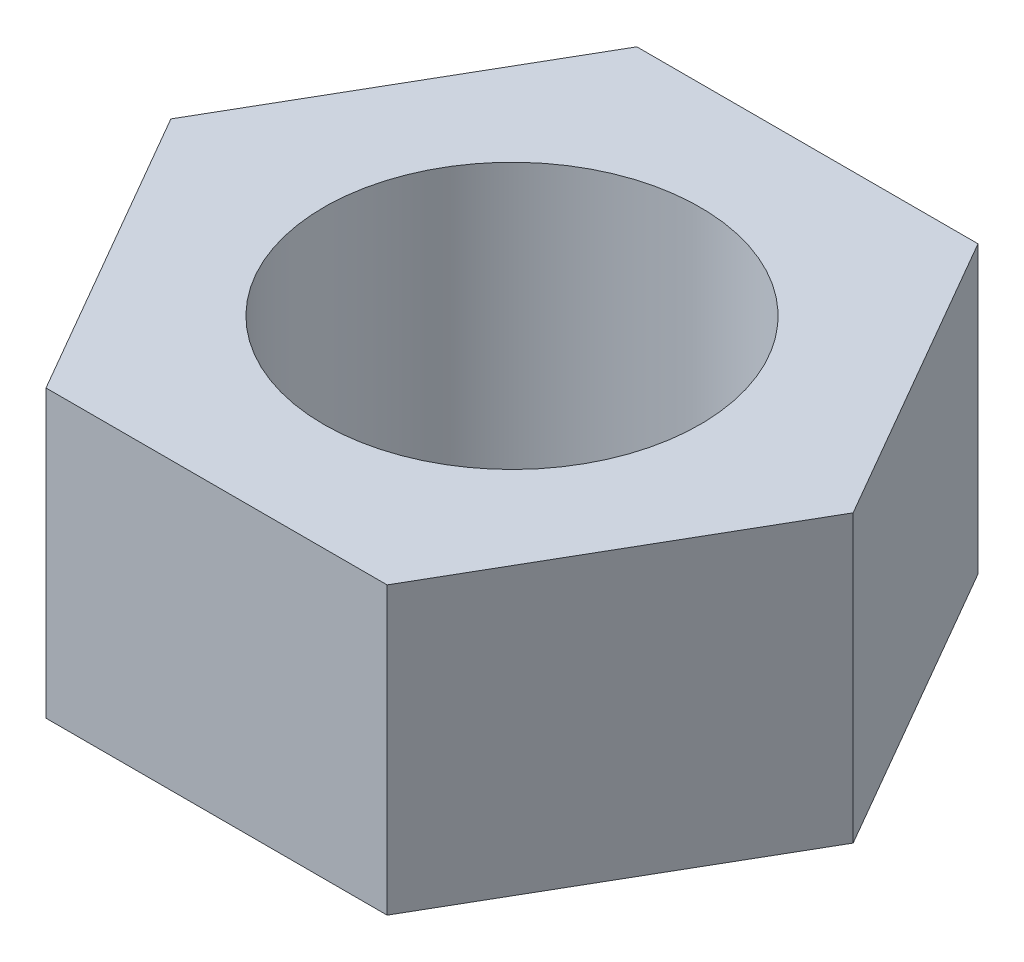
ISO-10303-21;
HEADER;
FILE_DESCRIPTION(('STEP AP214'),'2;1');
FILE_NAME('part.step','',(''),(''),'','','');
FILE_SCHEMA(('AUTOMOTIVE_DESIGN { 1 0 10303 214 1 1 1 1 }'));
ENDSEC;
DATA;
#1=APPLICATION_CONTEXT('core data for automotive mechanical design processes');
#2=APPLICATION_PROTOCOL_DEFINITION('international standard','automotive_design',2000,#1);
#3=PRODUCT_CONTEXT('',#1,'mechanical');
#4=PRODUCT('Part','Part','',(#3));
#5=PRODUCT_RELATED_PRODUCT_CATEGORY('part','',(#4));
#6=PRODUCT_DEFINITION_FORMATION('','',#4);
#7=PRODUCT_DEFINITION_CONTEXT('part definition',#1,'design');
#8=PRODUCT_DEFINITION('design','',#6,#7);
#9=PRODUCT_DEFINITION_SHAPE('','',#8);
#10=(LENGTH_UNIT() NAMED_UNIT(*) SI_UNIT(.MILLI.,.METRE.));
#11=(NAMED_UNIT(*) PLANE_ANGLE_UNIT() SI_UNIT($,.RADIAN.));
#12=(NAMED_UNIT(*) SI_UNIT($,.STERADIAN.) SOLID_ANGLE_UNIT());
#13=UNCERTAINTY_MEASURE_WITH_UNIT(LENGTH_MEASURE(1.E-05),#10,'distance_accuracy_value','');
#14=(GEOMETRIC_REPRESENTATION_CONTEXT(3) GLOBAL_UNCERTAINTY_ASSIGNED_CONTEXT((#13)) GLOBAL_UNIT_ASSIGNED_CONTEXT((#10,
#11,#12)) REPRESENTATION_CONTEXT('',''));
#15=CARTESIAN_POINT('',(0.,0.,0.));
#16=DIRECTION('',(0.,0.,1.));
#17=DIRECTION('',(1.,0.,0.));
#18=AXIS2_PLACEMENT_3D('',#15,#16,#17);
#19=CARTESIAN_POINT('',(0.,3.8,0.));
#20=DIRECTION('',(0.,1.,0.));
#21=DIRECTION('',(0.,0.,1.));
#22=AXIS2_PLACEMENT_3D('',#19,#20,#21);
#23=PLANE('',#22);
#24=DIRECTION('',(0.5,0.,-0.866025403784439));
#25=VECTOR('',#24,1.);
#26=CARTESIAN_POINT('',(2.26609980656928,3.8,3.925));
#27=LINE('',#26,#25);
#28=CARTESIAN_POINT('',(2.26609980656928,3.8,3.925));
#29=VERTEX_POINT('',#28);
#30=CARTESIAN_POINT('',(4.53219961313856,3.8,0.));
#31=VERTEX_POINT('',#30);
#32=EDGE_CURVE('E129',#29,#31,#27,.T.);
#33=ORIENTED_EDGE('',*,*,#32,.T.);
#34=DIRECTION('',(-0.5,0.,-0.866025403784439));
#35=VECTOR('',#34,1.);
#36=CARTESIAN_POINT('',(4.53219961313856,3.8,0.));
#37=LINE('',#36,#35);
#38=CARTESIAN_POINT('',(2.26609980656928,3.8,-3.925));
#39=VERTEX_POINT('',#38);
#40=EDGE_CURVE('E87',#31,#39,#37,.T.);
#41=ORIENTED_EDGE('',*,*,#40,.T.);
#42=DIRECTION('',(-1.,0.,0.));
#43=VECTOR('',#42,1.);
#44=CARTESIAN_POINT('',(2.26609980656928,3.8,-3.925));
#45=LINE('',#44,#43);
#46=CARTESIAN_POINT('',(-2.26609980656928,3.8,-3.925));
#47=VERTEX_POINT('',#46);
#48=EDGE_CURVE('E100',#39,#47,#45,.T.);
#49=ORIENTED_EDGE('',*,*,#48,.T.);
#50=DIRECTION('',(-0.5,0.,0.866025403784439));
#51=VECTOR('',#50,1.);
#52=CARTESIAN_POINT('',(-2.26609980656928,3.8,-3.925));
#53=LINE('',#52,#51);
#54=CARTESIAN_POINT('',(-4.53219961313856,3.8,0.));
#55=VERTEX_POINT('',#54);
#56=EDGE_CURVE('E94',#47,#55,#53,.T.);
#57=ORIENTED_EDGE('',*,*,#56,.T.);
#58=DIRECTION('',(0.5,0.,0.866025403784439));
#59=VECTOR('',#58,1.);
#60=CARTESIAN_POINT('',(-4.53219961313856,3.8,0.));
#61=LINE('',#60,#59);
#62=CARTESIAN_POINT('',(-2.26609980656928,3.8,3.925));
#63=VERTEX_POINT('',#62);
#64=EDGE_CURVE('E98',#55,#63,#61,.T.);
#65=ORIENTED_EDGE('',*,*,#64,.T.);
#66=DIRECTION('',(1.,0.,0.));
#67=VECTOR('',#66,1.);
#68=CARTESIAN_POINT('',(-2.26609980656928,3.8,3.925));
#69=LINE('',#68,#67);
#70=EDGE_CURVE('E50',#63,#29,#69,.T.);
#71=ORIENTED_EDGE('',*,*,#70,.T.);
#72=EDGE_LOOP('',(#33,#41,#49,#57,#65,#71));
#73=FACE_BOUND('',#72,.T.);
#74=CARTESIAN_POINT('',(0.,3.8,0.));
#75=DIRECTION('',(0.,1.,0.));
#76=DIRECTION('',(0.,0.,1.));
#77=AXIS2_PLACEMENT_3D('',#74,#75,#76);
#78=CIRCLE('',#77,2.5);
#79=CARTESIAN_POINT('',(0.,3.8,2.5));
#80=VERTEX_POINT('',#79);
#81=EDGE_CURVE('E122',#80,#80,#78,.T.);
#82=ORIENTED_EDGE('',*,*,#81,.F.);
#83=EDGE_LOOP('',(#82));
#84=FACE_BOUND('',#83,.T.);
#85=ADVANCED_FACE('F33',(#73,#84),#23,.T.);
#86=CARTESIAN_POINT('',(0.,0.,0.));
#87=DIRECTION('',(0.,1.,0.));
#88=DIRECTION('',(0.,0.,1.));
#89=AXIS2_PLACEMENT_3D('',#86,#87,#88);
#90=PLANE('',#89);
#91=DIRECTION('',(0.5,0.,-0.866025403784439));
#92=VECTOR('',#91,1.);
#93=CARTESIAN_POINT('',(2.26609980656928,0.,3.925));
#94=LINE('',#93,#92);
#95=CARTESIAN_POINT('',(2.26609980656928,0.,3.925));
#96=VERTEX_POINT('',#95);
#97=CARTESIAN_POINT('',(4.53219961313856,0.,0.));
#98=VERTEX_POINT('',#97);
#99=EDGE_CURVE('E118',#96,#98,#94,.T.);
#100=ORIENTED_EDGE('',*,*,#99,.F.);
#101=DIRECTION('',(1.,0.,0.));
#102=VECTOR('',#101,1.);
#103=CARTESIAN_POINT('',(-2.26609980656928,0.,3.925));
#104=LINE('',#103,#102);
#105=CARTESIAN_POINT('',(-2.26609980656928,0.,3.925));
#106=VERTEX_POINT('',#105);
#107=EDGE_CURVE('E79',#106,#96,#104,.T.);
#108=ORIENTED_EDGE('',*,*,#107,.F.);
#109=DIRECTION('',(0.5,0.,0.866025403784439));
#110=VECTOR('',#109,1.);
#111=CARTESIAN_POINT('',(-4.53219961313856,0.,0.));
#112=LINE('',#111,#110);
#113=CARTESIAN_POINT('',(-4.53219961313856,0.,0.));
#114=VERTEX_POINT('',#113);
#115=EDGE_CURVE('E73',#114,#106,#112,.T.);
#116=ORIENTED_EDGE('',*,*,#115,.F.);
#117=DIRECTION('',(-0.5,0.,0.866025403784439));
#118=VECTOR('',#117,1.);
#119=CARTESIAN_POINT('',(-2.26609980656928,0.,-3.925));
#120=LINE('',#119,#118);
#121=CARTESIAN_POINT('',(-2.26609980656928,0.,-3.925));
#122=VERTEX_POINT('',#121);
#123=EDGE_CURVE('E108',#122,#114,#120,.T.);
#124=ORIENTED_EDGE('',*,*,#123,.F.);
#125=DIRECTION('',(-1.,0.,0.));
#126=VECTOR('',#125,1.);
#127=CARTESIAN_POINT('',(2.26609980656928,0.,-3.925));
#128=LINE('',#127,#126);
#129=CARTESIAN_POINT('',(2.26609980656928,0.,-3.925));
#130=VERTEX_POINT('',#129);
#131=EDGE_CURVE('E124',#130,#122,#128,.T.);
#132=ORIENTED_EDGE('',*,*,#131,.F.);
#133=DIRECTION('',(-0.5,0.,-0.866025403784439));
#134=VECTOR('',#133,1.);
#135=CARTESIAN_POINT('',(4.53219961313856,0.,0.));
#136=LINE('',#135,#134);
#137=EDGE_CURVE('E121',#98,#130,#136,.T.);
#138=ORIENTED_EDGE('',*,*,#137,.F.);
#139=EDGE_LOOP('',(#100,#108,#116,#124,#132,#138));
#140=FACE_BOUND('',#139,.T.);
#141=CARTESIAN_POINT('',(0.,0.,0.));
#142=DIRECTION('',(0.,1.,0.));
#143=DIRECTION('',(0.,0.,1.));
#144=AXIS2_PLACEMENT_3D('',#141,#142,#143);
#145=CIRCLE('',#144,2.5);
#146=CARTESIAN_POINT('',(0.,0.,2.5));
#147=VERTEX_POINT('',#146);
#148=EDGE_CURVE('E222',#147,#147,#145,.T.);
#149=ORIENTED_EDGE('',*,*,#148,.T.);
#150=EDGE_LOOP('',(#149));
#151=FACE_BOUND('',#150,.T.);
#152=ADVANCED_FACE('F138',(#140,#151),#90,.F.);
#153=CARTESIAN_POINT('',(2.26609980656928,3.8,3.925));
#154=DIRECTION('',(-0.866025403784439,0.,-0.5));
#155=DIRECTION('',(-0.5,0.,0.866025403784439));
#156=AXIS2_PLACEMENT_3D('',#153,#154,#155);
#157=PLANE('',#156);
#158=ORIENTED_EDGE('',*,*,#99,.T.);
#159=DIRECTION('',(0.,-1.,0.));
#160=VECTOR('',#159,1.);
#161=CARTESIAN_POINT('',(4.53219961313856,3.8,0.));
#162=LINE('',#161,#160);
#163=EDGE_CURVE('E11',#31,#98,#162,.T.);
#164=ORIENTED_EDGE('',*,*,#163,.F.);
#165=ORIENTED_EDGE('',*,*,#32,.F.);
#166=DIRECTION('',(0.,-1.,0.));
#167=VECTOR('',#166,1.);
#168=CARTESIAN_POINT('',(2.26609980656928,3.8,3.925));
#169=LINE('',#168,#167);
#170=EDGE_CURVE('E114',#29,#96,#169,.T.);
#171=ORIENTED_EDGE('',*,*,#170,.T.);
#172=EDGE_LOOP('',(#158,#164,#165,#171));
#173=FACE_BOUND('',#172,.T.);
#174=ADVANCED_FACE('F35',(#173),#157,.F.);
#175=CARTESIAN_POINT('',(4.53219961313856,3.8,0.));
#176=DIRECTION('',(-0.866025403784438,0.,0.5));
#177=DIRECTION('',(0.5,0.,0.866025403784439));
#178=AXIS2_PLACEMENT_3D('',#175,#176,#177);
#179=PLANE('',#178);
#180=ORIENTED_EDGE('',*,*,#137,.T.);
#181=DIRECTION('',(0.,-1.,0.));
#182=VECTOR('',#181,1.);
#183=CARTESIAN_POINT('',(2.26609980656928,3.8,-3.925));
#184=LINE('',#183,#182);
#185=EDGE_CURVE('E42',#39,#130,#184,.T.);
#186=ORIENTED_EDGE('',*,*,#185,.F.);
#187=ORIENTED_EDGE('',*,*,#40,.F.);
#188=ORIENTED_EDGE('',*,*,#163,.T.);
#189=EDGE_LOOP('',(#180,#186,#187,#188));
#190=FACE_BOUND('',#189,.T.);
#191=ADVANCED_FACE('F163',(#190),#179,.F.);
#192=CARTESIAN_POINT('',(2.26609980656928,3.8,-3.925));
#193=DIRECTION('',(0.,0.,1.));
#194=DIRECTION('',(1.,0.,0.));
#195=AXIS2_PLACEMENT_3D('',#192,#193,#194);
#196=PLANE('',#195);
#197=ORIENTED_EDGE('',*,*,#131,.T.);
#198=DIRECTION('',(0.,-1.,0.));
#199=VECTOR('',#198,1.);
#200=CARTESIAN_POINT('',(-2.26609980656928,3.8,-3.925));
#201=LINE('',#200,#199);
#202=EDGE_CURVE('E109',#47,#122,#201,.T.);
#203=ORIENTED_EDGE('',*,*,#202,.F.);
#204=ORIENTED_EDGE('',*,*,#48,.F.);
#205=ORIENTED_EDGE('',*,*,#185,.T.);
#206=EDGE_LOOP('',(#197,#203,#204,#205));
#207=FACE_BOUND('',#206,.T.);
#208=ADVANCED_FACE('F135',(#207),#196,.F.);
#209=CARTESIAN_POINT('',(-2.26609980656928,3.8,-3.925));
#210=DIRECTION('',(0.866025403784439,0.,0.5));
#211=DIRECTION('',(0.5,0.,-0.866025403784439));
#212=AXIS2_PLACEMENT_3D('',#209,#210,#211);
#213=PLANE('',#212);
#214=ORIENTED_EDGE('',*,*,#123,.T.);
#215=DIRECTION('',(0.,-1.,0.));
#216=VECTOR('',#215,1.);
#217=CARTESIAN_POINT('',(-4.53219961313856,3.8,0.));
#218=LINE('',#217,#216);
#219=EDGE_CURVE('E105',#55,#114,#218,.T.);
#220=ORIENTED_EDGE('',*,*,#219,.F.);
#221=ORIENTED_EDGE('',*,*,#56,.F.);
#222=ORIENTED_EDGE('',*,*,#202,.T.);
#223=EDGE_LOOP('',(#214,#220,#221,#222));
#224=FACE_BOUND('',#223,.T.);
#225=ADVANCED_FACE('F106',(#224),#213,.F.);
#226=CARTESIAN_POINT('',(-4.53219961313856,3.8,0.));
#227=DIRECTION('',(0.866025403784439,0.,-0.5));
#228=DIRECTION('',(-0.5,0.,-0.866025403784439));
#229=AXIS2_PLACEMENT_3D('',#226,#227,#228);
#230=PLANE('',#229);
#231=ORIENTED_EDGE('',*,*,#115,.T.);
#232=DIRECTION('',(0.,-1.,0.));
#233=VECTOR('',#232,1.);
#234=CARTESIAN_POINT('',(-2.26609980656928,3.8,3.925));
#235=LINE('',#234,#233);
#236=EDGE_CURVE('E110',#63,#106,#235,.T.);
#237=ORIENTED_EDGE('',*,*,#236,.F.);
#238=ORIENTED_EDGE('',*,*,#64,.F.);
#239=ORIENTED_EDGE('',*,*,#219,.T.);
#240=EDGE_LOOP('',(#231,#237,#238,#239));
#241=FACE_BOUND('',#240,.T.);
#242=ADVANCED_FACE('F112',(#241),#230,.F.);
#243=CARTESIAN_POINT('',(-2.26609980656928,3.8,3.925));
#244=DIRECTION('',(0.,0.,-1.));
#245=DIRECTION('',(-1.,0.,0.));
#246=AXIS2_PLACEMENT_3D('',#243,#244,#245);
#247=PLANE('',#246);
#248=ORIENTED_EDGE('',*,*,#107,.T.);
#249=ORIENTED_EDGE('',*,*,#170,.F.);
#250=ORIENTED_EDGE('',*,*,#70,.F.);
#251=ORIENTED_EDGE('',*,*,#236,.T.);
#252=EDGE_LOOP('',(#248,#249,#250,#251));
#253=FACE_BOUND('',#252,.T.);
#254=ADVANCED_FACE('F143',(#253),#247,.F.);
#255=CARTESIAN_POINT('',(0.,3.8,0.));
#256=DIRECTION('',(0.,-1.,0.));
#257=DIRECTION('',(0.,0.,-1.));
#258=AXIS2_PLACEMENT_3D('',#255,#256,#257);
#259=CYLINDRICAL_SURFACE('',#258,2.5);
#260=ORIENTED_EDGE('',*,*,#81,.T.);
#261=EDGE_LOOP('',(#260));
#262=FACE_BOUND('',#261,.T.);
#263=ORIENTED_EDGE('',*,*,#148,.F.);
#264=EDGE_LOOP('',(#263));
#265=FACE_BOUND('',#264,.T.);
#266=ADVANCED_FACE('F145',(#262,#265),#259,.F.);
#267=CLOSED_SHELL('',(#85,#152,#174,#191,#208,#225,#242,#254,#266));
#268=MANIFOLD_SOLID_BREP('B2',#267);
#269=ADVANCED_BREP_SHAPE_REPRESENTATION('',(#18,#268),#14);
#270=SHAPE_DEFINITION_REPRESENTATION(#9,#269);
ENDSEC;
END-ISO-10303-21;
